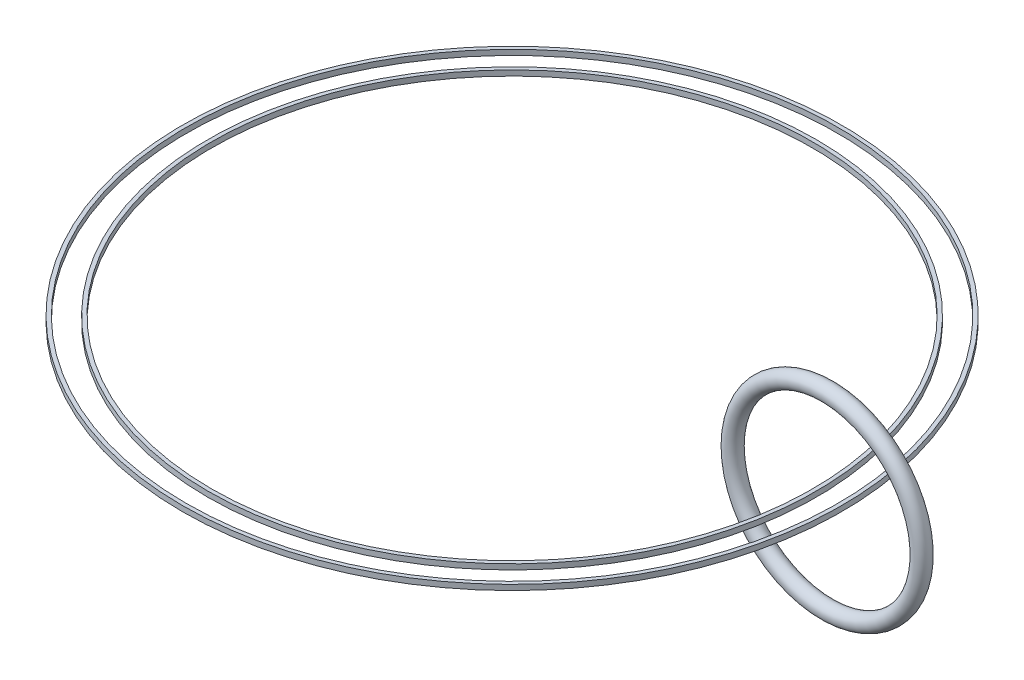
ISO-10303-21;
HEADER;
FILE_DESCRIPTION(('STEP AP214'),'2;1');
FILE_NAME('part.step','',(''),(''),'','','');
FILE_SCHEMA(('AUTOMOTIVE_DESIGN { 1 0 10303 214 1 1 1 1 }'));
ENDSEC;
DATA;
#1=APPLICATION_CONTEXT('core data for automotive mechanical design processes');
#2=APPLICATION_PROTOCOL_DEFINITION('international standard','automotive_design',2000,#1);
#3=PRODUCT_CONTEXT('',#1,'mechanical');
#4=PRODUCT('Part','Part','',(#3));
#5=PRODUCT_RELATED_PRODUCT_CATEGORY('part','',(#4));
#6=PRODUCT_DEFINITION_FORMATION('','',#4);
#7=PRODUCT_DEFINITION_CONTEXT('part definition',#1,'design');
#8=PRODUCT_DEFINITION('design','',#6,#7);
#9=PRODUCT_DEFINITION_SHAPE('','',#8);
#10=(LENGTH_UNIT() NAMED_UNIT(*) SI_UNIT(.MILLI.,.METRE.));
#11=(NAMED_UNIT(*) PLANE_ANGLE_UNIT() SI_UNIT($,.RADIAN.));
#12=(NAMED_UNIT(*) SI_UNIT($,.STERADIAN.) SOLID_ANGLE_UNIT());
#13=UNCERTAINTY_MEASURE_WITH_UNIT(LENGTH_MEASURE(1.E-05),#10,'distance_accuracy_value','');
#14=(GEOMETRIC_REPRESENTATION_CONTEXT(3) GLOBAL_UNCERTAINTY_ASSIGNED_CONTEXT((#13)) GLOBAL_UNIT_ASSIGNED_CONTEXT((#10,
#11,#12)) REPRESENTATION_CONTEXT('',''));
#15=CARTESIAN_POINT('',(0.,0.,0.));
#16=DIRECTION('',(0.,0.,1.));
#17=DIRECTION('',(1.,0.,0.));
#18=AXIS2_PLACEMENT_3D('',#15,#16,#17);
#19=CARTESIAN_POINT('',(0.,-85.0000000000001,0.));
#20=DIRECTION('',(0.,1.,0.));
#21=DIRECTION('',(0.,0.,1.));
#22=AXIS2_PLACEMENT_3D('',#19,#20,#21);
#23=PLANE('',#22);
#24=CARTESIAN_POINT('',(-13000.,-85.,0.));
#25=DIRECTION('',(0.,1.,0.));
#26=DIRECTION('',(0.,0.,1.));
#27=AXIS2_PLACEMENT_3D('',#24,#25,#26);
#28=CIRCLE('',#27,10460.);
#29=CARTESIAN_POINT('',(-13000.,-85.,10460.));
#30=VERTEX_POINT('',#29);
#31=EDGE_CURVE('E11',#30,#30,#28,.T.);
#32=ORIENTED_EDGE('',*,*,#31,.F.);
#33=EDGE_LOOP('',(#32));
#34=FACE_BOUND('',#33,.T.);
#35=CARTESIAN_POINT('',(-13000.,-85.,0.));
#36=DIRECTION('',(0.,1.,0.));
#37=DIRECTION('',(0.,0.,1.));
#38=AXIS2_PLACEMENT_3D('',#35,#36,#37);
#39=CIRCLE('',#38,10340.);
#40=CARTESIAN_POINT('',(-13000.,-85.,10340.));
#41=VERTEX_POINT('',#40);
#42=EDGE_CURVE('E64',#41,#41,#39,.T.);
#43=ORIENTED_EDGE('',*,*,#42,.T.);
#44=EDGE_LOOP('',(#43));
#45=FACE_BOUND('',#44,.T.);
#46=ADVANCED_FACE('F47',(#34,#45),#23,.F.);
#47=CARTESIAN_POINT('',(-13000.,4286.79523513443,0.));
#48=DIRECTION('',(0.,1.,0.));
#49=DIRECTION('',(0.,0.,1.));
#50=AXIS2_PLACEMENT_3D('',#47,#48,#49);
#51=CYLINDRICAL_SURFACE('',#50,10460.);
#52=CARTESIAN_POINT('',(-13000.,85.,0.));
#53=DIRECTION('',(0.,1.,0.));
#54=DIRECTION('',(0.,0.,1.));
#55=AXIS2_PLACEMENT_3D('',#52,#53,#54);
#56=CIRCLE('',#55,10460.);
#57=CARTESIAN_POINT('',(-13000.,85.,10460.));
#58=VERTEX_POINT('',#57);
#59=EDGE_CURVE('E54',#58,#58,#56,.T.);
#60=ORIENTED_EDGE('',*,*,#59,.F.);
#61=EDGE_LOOP('',(#60));
#62=FACE_BOUND('',#61,.T.);
#63=ORIENTED_EDGE('',*,*,#31,.T.);
#64=EDGE_LOOP('',(#63));
#65=FACE_BOUND('',#64,.T.);
#66=ADVANCED_FACE('F110',(#62,#65),#51,.T.);
#67=CARTESIAN_POINT('',(0.,84.9999999999999,0.));
#68=DIRECTION('',(0.,1.,0.));
#69=DIRECTION('',(0.,0.,1.));
#70=AXIS2_PLACEMENT_3D('',#67,#68,#69);
#71=PLANE('',#70);
#72=ORIENTED_EDGE('',*,*,#59,.T.);
#73=EDGE_LOOP('',(#72));
#74=FACE_BOUND('',#73,.T.);
#75=CARTESIAN_POINT('',(-13000.,85.,0.));
#76=DIRECTION('',(0.,1.,0.));
#77=DIRECTION('',(0.,0.,1.));
#78=AXIS2_PLACEMENT_3D('',#75,#76,#77);
#79=CIRCLE('',#78,10340.);
#80=CARTESIAN_POINT('',(-13000.,85.,10340.));
#81=VERTEX_POINT('',#80);
#82=EDGE_CURVE('E59',#81,#81,#79,.T.);
#83=ORIENTED_EDGE('',*,*,#82,.F.);
#84=EDGE_LOOP('',(#83));
#85=FACE_BOUND('',#84,.T.);
#86=ADVANCED_FACE('F107',(#74,#85),#71,.T.);
#87=CARTESIAN_POINT('',(-13000.,4286.79523513443,0.));
#88=DIRECTION('',(0.,1.,0.));
#89=DIRECTION('',(0.,0.,1.));
#90=AXIS2_PLACEMENT_3D('',#87,#88,#89);
#91=CYLINDRICAL_SURFACE('',#90,10340.);
#92=ORIENTED_EDGE('',*,*,#82,.T.);
#93=EDGE_LOOP('',(#92));
#94=FACE_BOUND('',#93,.T.);
#95=ORIENTED_EDGE('',*,*,#42,.F.);
#96=EDGE_LOOP('',(#95));
#97=FACE_BOUND('',#96,.T.);
#98=ADVANCED_FACE('F105',(#94,#97),#91,.F.);
#99=CLOSED_SHELL('',(#46,#66,#86,#98));
#100=CARTESIAN_POINT('',(0.,-75.0000000000001,0.));
#101=DIRECTION('',(0.,1.,0.));
#102=DIRECTION('',(0.,0.,1.));
#103=AXIS2_PLACEMENT_3D('',#100,#101,#102);
#104=PLANE('',#103);
#105=CARTESIAN_POINT('',(-13000.,-75.0000000000002,0.));
#106=DIRECTION('',(0.,1.,0.));
#107=DIRECTION('',(0.,0.,1.));
#108=AXIS2_PLACEMENT_3D('',#105,#106,#107);
#109=CIRCLE('',#108,10450.);
#110=CARTESIAN_POINT('',(-13000.,-75.0000000000002,10450.));
#111=VERTEX_POINT('',#110);
#112=EDGE_CURVE('E70',#111,#111,#109,.T.);
#113=ORIENTED_EDGE('',*,*,#112,.T.);
#114=EDGE_LOOP('',(#113));
#115=FACE_BOUND('',#114,.T.);
#116=CARTESIAN_POINT('',(-13000.,-75.0000000000002,0.));
#117=DIRECTION('',(0.,1.,0.));
#118=DIRECTION('',(0.,0.,1.));
#119=AXIS2_PLACEMENT_3D('',#116,#117,#118);
#120=CIRCLE('',#119,10350.);
#121=CARTESIAN_POINT('',(-13000.,-75.0000000000002,10350.));
#122=VERTEX_POINT('',#121);
#123=EDGE_CURVE('E82',#122,#122,#120,.T.);
#124=ORIENTED_EDGE('',*,*,#123,.F.);
#125=EDGE_LOOP('',(#124));
#126=FACE_BOUND('',#125,.T.);
#127=ADVANCED_FACE('F89',(#115,#126),#104,.T.);
#128=CARTESIAN_POINT('',(-13000.,4286.79523513443,0.));
#129=DIRECTION('',(0.,1.,0.));
#130=DIRECTION('',(0.,0.,1.));
#131=AXIS2_PLACEMENT_3D('',#128,#129,#130);
#132=CYLINDRICAL_SURFACE('',#131,10450.);
#133=CARTESIAN_POINT('',(-13000.,75.0000000000002,0.));
#134=DIRECTION('',(0.,1.,0.));
#135=DIRECTION('',(0.,0.,1.));
#136=AXIS2_PLACEMENT_3D('',#133,#134,#135);
#137=CIRCLE('',#136,10450.);
#138=CARTESIAN_POINT('',(-13000.,75.0000000000002,10450.));
#139=VERTEX_POINT('',#138);
#140=EDGE_CURVE('E74',#139,#139,#137,.T.);
#141=ORIENTED_EDGE('',*,*,#140,.T.);
#142=EDGE_LOOP('',(#141));
#143=FACE_BOUND('',#142,.T.);
#144=ORIENTED_EDGE('',*,*,#112,.F.);
#145=EDGE_LOOP('',(#144));
#146=FACE_BOUND('',#145,.T.);
#147=ADVANCED_FACE('F91',(#143,#146),#132,.F.);
#148=CARTESIAN_POINT('',(0.,74.9999999999999,0.));
#149=DIRECTION('',(0.,1.,0.));
#150=DIRECTION('',(0.,0.,1.));
#151=AXIS2_PLACEMENT_3D('',#148,#149,#150);
#152=PLANE('',#151);
#153=ORIENTED_EDGE('',*,*,#140,.F.);
#154=EDGE_LOOP('',(#153));
#155=FACE_BOUND('',#154,.T.);
#156=CARTESIAN_POINT('',(-13000.,75.0000000000002,0.));
#157=DIRECTION('',(0.,1.,0.));
#158=DIRECTION('',(0.,0.,1.));
#159=AXIS2_PLACEMENT_3D('',#156,#157,#158);
#160=CIRCLE('',#159,10350.);
#161=CARTESIAN_POINT('',(-13000.,75.0000000000002,10350.));
#162=VERTEX_POINT('',#161);
#163=EDGE_CURVE('E78',#162,#162,#160,.T.);
#164=ORIENTED_EDGE('',*,*,#163,.T.);
#165=EDGE_LOOP('',(#164));
#166=FACE_BOUND('',#165,.T.);
#167=ADVANCED_FACE('F99',(#155,#166),#152,.F.);
#168=CARTESIAN_POINT('',(-13000.,4286.79523513443,0.));
#169=DIRECTION('',(0.,1.,0.));
#170=DIRECTION('',(0.,0.,1.));
#171=AXIS2_PLACEMENT_3D('',#168,#169,#170);
#172=CYLINDRICAL_SURFACE('',#171,10350.);
#173=ORIENTED_EDGE('',*,*,#163,.F.);
#174=EDGE_LOOP('',(#173));
#175=FACE_BOUND('',#174,.T.);
#176=ORIENTED_EDGE('',*,*,#123,.T.);
#177=EDGE_LOOP('',(#176));
#178=FACE_BOUND('',#177,.T.);
#179=ADVANCED_FACE('F87',(#175,#178),#172,.T.);
#180=CLOSED_SHELL('',(#127,#147,#167,#179));
#181=ORIENTED_CLOSED_SHELL('',*,#180,.T.);
#182=BREP_WITH_VOIDS('B2',#99,(#181));
#183=CARTESIAN_POINT('',(-13000.,4286.79523513443,0.));
#184=DIRECTION('',(0.,1.,0.));
#185=DIRECTION('',(0.,0.,1.));
#186=AXIS2_PLACEMENT_3D('',#183,#184,#185);
#187=CYLINDRICAL_SURFACE('',#186,9540.);
#188=CARTESIAN_POINT('',(-13000.,85.,0.));
#189=DIRECTION('',(0.,1.,0.));
#190=DIRECTION('',(0.,0.,1.));
#191=AXIS2_PLACEMENT_3D('',#188,#189,#190);
#192=CIRCLE('',#191,9540.);
#193=CARTESIAN_POINT('',(-13000.,85.,9540.));
#194=VERTEX_POINT('',#193);
#195=EDGE_CURVE('E199',#194,#194,#192,.T.);
#196=ORIENTED_EDGE('',*,*,#195,.T.);
#197=EDGE_LOOP('',(#196));
#198=FACE_BOUND('',#197,.T.);
#199=CARTESIAN_POINT('',(-13000.,-85.,0.));
#200=DIRECTION('',(0.,1.,0.));
#201=DIRECTION('',(0.,0.,1.));
#202=AXIS2_PLACEMENT_3D('',#199,#200,#201);
#203=CIRCLE('',#202,9540.);
#204=CARTESIAN_POINT('',(-13000.,-85.,9540.));
#205=VERTEX_POINT('',#204);
#206=EDGE_CURVE('E45',#205,#205,#203,.T.);
#207=ORIENTED_EDGE('',*,*,#206,.F.);
#208=EDGE_LOOP('',(#207));
#209=FACE_BOUND('',#208,.T.);
#210=ADVANCED_FACE('F185',(#198,#209),#187,.F.);
#211=CARTESIAN_POINT('',(0.,-84.9999999999997,0.));
#212=DIRECTION('',(0.,-1.,0.));
#213=DIRECTION('',(0.,0.,-1.));
#214=AXIS2_PLACEMENT_3D('',#211,#212,#213);
#215=PLANE('',#214);
#216=ORIENTED_EDGE('',*,*,#206,.T.);
#217=EDGE_LOOP('',(#216));
#218=FACE_BOUND('',#217,.T.);
#219=CARTESIAN_POINT('',(-13000.,-85.,0.));
#220=DIRECTION('',(0.,1.,0.));
#221=DIRECTION('',(0.,0.,1.));
#222=AXIS2_PLACEMENT_3D('',#219,#220,#221);
#223=CIRCLE('',#222,9660.);
#224=CARTESIAN_POINT('',(-13000.,-85.,9660.));
#225=VERTEX_POINT('',#224);
#226=EDGE_CURVE('E191',#225,#225,#223,.T.);
#227=ORIENTED_EDGE('',*,*,#226,.F.);
#228=EDGE_LOOP('',(#227));
#229=FACE_BOUND('',#228,.T.);
#230=ADVANCED_FACE('F249',(#218,#229),#215,.T.);
#231=CARTESIAN_POINT('',(-13000.,4286.79523513443,0.));
#232=DIRECTION('',(0.,1.,0.));
#233=DIRECTION('',(0.,0.,1.));
#234=AXIS2_PLACEMENT_3D('',#231,#232,#233);
#235=CYLINDRICAL_SURFACE('',#234,9660.);
#236=CARTESIAN_POINT('',(-13000.,85.,0.));
#237=DIRECTION('',(0.,1.,0.));
#238=DIRECTION('',(0.,0.,1.));
#239=AXIS2_PLACEMENT_3D('',#236,#237,#238);
#240=CIRCLE('',#239,9660.);
#241=CARTESIAN_POINT('',(-13000.,85.,9660.));
#242=VERTEX_POINT('',#241);
#243=EDGE_CURVE('E195',#242,#242,#240,.T.);
#244=ORIENTED_EDGE('',*,*,#243,.F.);
#245=EDGE_LOOP('',(#244));
#246=FACE_BOUND('',#245,.T.);
#247=ORIENTED_EDGE('',*,*,#226,.T.);
#248=EDGE_LOOP('',(#247));
#249=FACE_BOUND('',#248,.T.);
#250=ADVANCED_FACE('F246',(#246,#249),#235,.T.);
#251=CARTESIAN_POINT('',(0.,85.0000000000002,0.));
#252=DIRECTION('',(0.,-1.,0.));
#253=DIRECTION('',(0.,0.,-1.));
#254=AXIS2_PLACEMENT_3D('',#251,#252,#253);
#255=PLANE('',#254);
#256=ORIENTED_EDGE('',*,*,#195,.F.);
#257=EDGE_LOOP('',(#256));
#258=FACE_BOUND('',#257,.T.);
#259=ORIENTED_EDGE('',*,*,#243,.T.);
#260=EDGE_LOOP('',(#259));
#261=FACE_BOUND('',#260,.T.);
#262=ADVANCED_FACE('F243',(#258,#261),#255,.F.);
#263=CLOSED_SHELL('',(#210,#230,#250,#262));
#264=CARTESIAN_POINT('',(-13000.,4286.79523513443,0.));
#265=DIRECTION('',(0.,1.,0.));
#266=DIRECTION('',(0.,0.,1.));
#267=AXIS2_PLACEMENT_3D('',#264,#265,#266);
#268=CYLINDRICAL_SURFACE('',#267,9550.);
#269=CARTESIAN_POINT('',(-13000.,75.0000000000002,0.));
#270=DIRECTION('',(0.,1.,0.));
#271=DIRECTION('',(0.,0.,1.));
#272=AXIS2_PLACEMENT_3D('',#269,#270,#271);
#273=CIRCLE('',#272,9550.);
#274=CARTESIAN_POINT('',(-13000.,75.0000000000002,9550.));
#275=VERTEX_POINT('',#274);
#276=EDGE_CURVE('E213',#275,#275,#273,.T.);
#277=ORIENTED_EDGE('',*,*,#276,.F.);
#278=EDGE_LOOP('',(#277));
#279=FACE_BOUND('',#278,.T.);
#280=CARTESIAN_POINT('',(-13000.,-75.0000000000002,0.));
#281=DIRECTION('',(0.,1.,0.));
#282=DIRECTION('',(0.,0.,1.));
#283=AXIS2_PLACEMENT_3D('',#280,#281,#282);
#284=CIRCLE('',#283,9550.);
#285=CARTESIAN_POINT('',(-13000.,-75.0000000000002,9550.));
#286=VERTEX_POINT('',#285);
#287=EDGE_CURVE('E204',#286,#286,#284,.T.);
#288=ORIENTED_EDGE('',*,*,#287,.T.);
#289=EDGE_LOOP('',(#288));
#290=FACE_BOUND('',#289,.T.);
#291=ADVANCED_FACE('F220',(#279,#290),#268,.T.);
#292=CARTESIAN_POINT('',(0.,-74.9999999999997,0.));
#293=DIRECTION('',(0.,-1.,0.));
#294=DIRECTION('',(0.,0.,-1.));
#295=AXIS2_PLACEMENT_3D('',#292,#293,#294);
#296=PLANE('',#295);
#297=ORIENTED_EDGE('',*,*,#287,.F.);
#298=EDGE_LOOP('',(#297));
#299=FACE_BOUND('',#298,.T.);
#300=CARTESIAN_POINT('',(-13000.,-74.9999999999993,0.));
#301=DIRECTION('',(0.,1.,0.));
#302=DIRECTION('',(0.,0.,1.));
#303=AXIS2_PLACEMENT_3D('',#300,#301,#302);
#304=CIRCLE('',#303,9650.);
#305=CARTESIAN_POINT('',(-13000.,-74.9999999999993,9650.));
#306=VERTEX_POINT('',#305);
#307=EDGE_CURVE('E207',#306,#306,#304,.T.);
#308=ORIENTED_EDGE('',*,*,#307,.T.);
#309=EDGE_LOOP('',(#308));
#310=FACE_BOUND('',#309,.T.);
#311=ADVANCED_FACE('F223',(#299,#310),#296,.F.);
#312=CARTESIAN_POINT('',(-13000.,4286.79523513443,0.));
#313=DIRECTION('',(0.,1.,0.));
#314=DIRECTION('',(0.,0.,1.));
#315=AXIS2_PLACEMENT_3D('',#312,#313,#314);
#316=CYLINDRICAL_SURFACE('',#315,9650.);
#317=CARTESIAN_POINT('',(-13000.,75.0000000000002,0.));
#318=DIRECTION('',(0.,1.,0.));
#319=DIRECTION('',(0.,0.,1.));
#320=AXIS2_PLACEMENT_3D('',#317,#318,#319);
#321=CIRCLE('',#320,9650.);
#322=CARTESIAN_POINT('',(-13000.,75.0000000000002,9650.));
#323=VERTEX_POINT('',#322);
#324=EDGE_CURVE('E210',#323,#323,#321,.T.);
#325=ORIENTED_EDGE('',*,*,#324,.T.);
#326=EDGE_LOOP('',(#325));
#327=FACE_BOUND('',#326,.T.);
#328=ORIENTED_EDGE('',*,*,#307,.F.);
#329=EDGE_LOOP('',(#328));
#330=FACE_BOUND('',#329,.T.);
#331=ADVANCED_FACE('F230',(#327,#330),#316,.F.);
#332=CARTESIAN_POINT('',(0.,75.0000000000002,0.));
#333=DIRECTION('',(0.,-1.,0.));
#334=DIRECTION('',(0.,0.,-1.));
#335=AXIS2_PLACEMENT_3D('',#332,#333,#334);
#336=PLANE('',#335);
#337=ORIENTED_EDGE('',*,*,#276,.T.);
#338=EDGE_LOOP('',(#337));
#339=FACE_BOUND('',#338,.T.);
#340=ORIENTED_EDGE('',*,*,#324,.F.);
#341=EDGE_LOOP('',(#340));
#342=FACE_BOUND('',#341,.T.);
#343=ADVANCED_FACE('F217',(#339,#342),#336,.T.);
#344=CLOSED_SHELL('',(#291,#311,#331,#343));
#345=ORIENTED_CLOSED_SHELL('',*,#344,.T.);
#346=BREP_WITH_VOIDS('B6',#263,(#345));
#347=CARTESIAN_POINT('',(-3000.,0.,0.));
#348=DIRECTION('',(0.,0.,-1.));
#349=DIRECTION('',(-1.,0.,0.));
#350=AXIS2_PLACEMENT_3D('',#347,#348,#349);
#351=TOROIDAL_SURFACE('',#350,3000.,260.);
#352=CARTESIAN_POINT('',(-6260.,0.,0.));
#353=VERTEX_POINT('',#352);
#354=VERTEX_LOOP('',#353);
#355=FACE_BOUND('',#354,.T.);
#356=ADVANCED_FACE('F310',(#355),#351,.T.);
#357=CLOSED_SHELL('',(#356));
#358=CARTESIAN_POINT('',(-3000.,0.,0.));
#359=DIRECTION('',(0.,0.,-1.));
#360=DIRECTION('',(-1.,0.,0.));
#361=AXIS2_PLACEMENT_3D('',#358,#359,#360);
#362=TOROIDAL_SURFACE('',#361,3000.,250.);
#363=CARTESIAN_POINT('',(-6250.,0.,0.));
#364=VERTEX_POINT('',#363);
#365=VERTEX_LOOP('',#364);
#366=FACE_BOUND('',#365,.T.);
#367=ADVANCED_FACE('F322',(#366),#362,.F.);
#368=CLOSED_SHELL('',(#367));
#369=ORIENTED_CLOSED_SHELL('',*,#368,.T.);
#370=BREP_WITH_VOIDS('B40',#357,(#369));
#371=ADVANCED_BREP_SHAPE_REPRESENTATION('',(#18,#182,#346,#370),#14);
#372=SHAPE_DEFINITION_REPRESENTATION(#9,#371);
ENDSEC;
END-ISO-10303-21;
